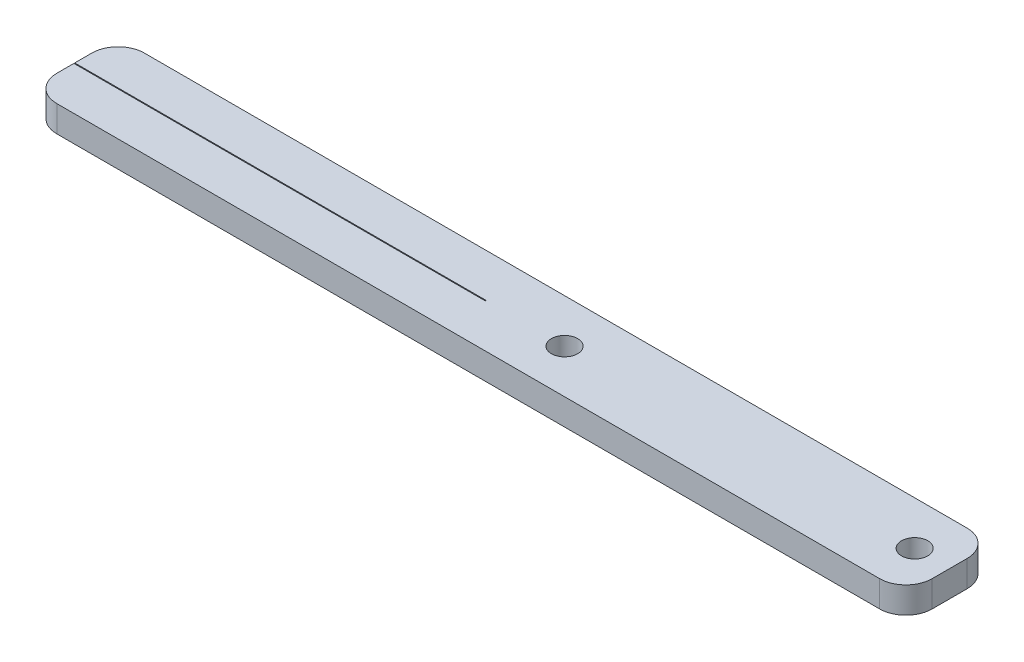
ISO-10303-21;
HEADER;
FILE_DESCRIPTION(('STEP AP214'),'2;1');
FILE_NAME('part.step','',(''),(''),'','','');
FILE_SCHEMA(('AUTOMOTIVE_DESIGN { 1 0 10303 214 1 1 1 1 }'));
ENDSEC;
DATA;
#1=APPLICATION_CONTEXT('core data for automotive mechanical design processes');
#2=APPLICATION_PROTOCOL_DEFINITION('international standard','automotive_design',2000,#1);
#3=PRODUCT_CONTEXT('',#1,'mechanical');
#4=PRODUCT('Part','Part','',(#3));
#5=PRODUCT_RELATED_PRODUCT_CATEGORY('part','',(#4));
#6=PRODUCT_DEFINITION_FORMATION('','',#4);
#7=PRODUCT_DEFINITION_CONTEXT('part definition',#1,'design');
#8=PRODUCT_DEFINITION('design','',#6,#7);
#9=PRODUCT_DEFINITION_SHAPE('','',#8);
#10=(LENGTH_UNIT() NAMED_UNIT(*) SI_UNIT(.MILLI.,.METRE.));
#11=(NAMED_UNIT(*) PLANE_ANGLE_UNIT() SI_UNIT($,.RADIAN.));
#12=(NAMED_UNIT(*) SI_UNIT($,.STERADIAN.) SOLID_ANGLE_UNIT());
#13=UNCERTAINTY_MEASURE_WITH_UNIT(LENGTH_MEASURE(1.E-05),#10,'distance_accuracy_value','');
#14=(GEOMETRIC_REPRESENTATION_CONTEXT(3) GLOBAL_UNCERTAINTY_ASSIGNED_CONTEXT((#13)) GLOBAL_UNIT_ASSIGNED_CONTEXT((#10,
#11,#12)) REPRESENTATION_CONTEXT('',''));
#15=CARTESIAN_POINT('',(0.,0.,0.));
#16=DIRECTION('',(0.,0.,1.));
#17=DIRECTION('',(1.,0.,0.));
#18=AXIS2_PLACEMENT_3D('',#15,#16,#17);
#19=CARTESIAN_POINT('',(-50.,3.,-4.99999999999999));
#20=DIRECTION('',(1.,0.,0.));
#21=DIRECTION('',(0.,0.,-1.));
#22=AXIS2_PLACEMENT_3D('',#19,#20,#21);
#23=PLANE('',#22);
#24=DIRECTION('',(0.,0.,1.));
#25=VECTOR('',#24,1.);
#26=CARTESIAN_POINT('',(-50.,0.,-4.99999999999999));
#27=LINE('',#26,#25);
#28=CARTESIAN_POINT('',(-50.,0.,-1.99999999999998));
#29=VERTEX_POINT('',#28);
#30=CARTESIAN_POINT('',(-50.,0.,-0.0499999999999945));
#31=VERTEX_POINT('',#30);
#32=EDGE_CURVE('E184',#29,#31,#27,.T.);
#33=ORIENTED_EDGE('',*,*,#32,.T.);
#34=DIRECTION('',(0.,0.999999999999999,0.));
#35=VECTOR('',#34,1.);
#36=CARTESIAN_POINT('',(-50.,-7.,-0.0499999999999876));
#37=LINE('',#36,#35);
#38=CARTESIAN_POINT('',(-50.,3.,-0.0499999999999945));
#39=VERTEX_POINT('',#38);
#40=EDGE_CURVE('E233',#31,#39,#37,.T.);
#41=ORIENTED_EDGE('',*,*,#40,.T.);
#42=DIRECTION('',(0.,0.,1.));
#43=VECTOR('',#42,1.);
#44=CARTESIAN_POINT('',(-50.,3.,-4.99999999999999));
#45=LINE('',#44,#43);
#46=CARTESIAN_POINT('',(-50.,3.,-1.99999999999999));
#47=VERTEX_POINT('',#46);
#48=EDGE_CURVE('E165',#47,#39,#45,.T.);
#49=ORIENTED_EDGE('',*,*,#48,.F.);
#50=DIRECTION('',(0.,-0.999999999999999,0.));
#51=VECTOR('',#50,1.);
#52=CARTESIAN_POINT('',(-50.,3.,-1.99999999999999));
#53=LINE('',#52,#51);
#54=EDGE_CURVE('E190',#47,#29,#53,.T.);
#55=ORIENTED_EDGE('',*,*,#54,.T.);
#56=EDGE_LOOP('',(#33,#41,#49,#55));
#57=FACE_BOUND('',#56,.T.);
#58=ADVANCED_FACE('F51',(#57),#23,.F.);
#59=CARTESIAN_POINT('',(50.0000000000001,2.99999999999999,-4.99999999999998));
#60=DIRECTION('',(-1.,0.,0.));
#61=DIRECTION('',(0.,0.,1.));
#62=AXIS2_PLACEMENT_3D('',#59,#60,#61);
#63=PLANE('',#62);
#64=DIRECTION('',(0.,0.,-1.));
#65=VECTOR('',#64,1.);
#66=CARTESIAN_POINT('',(50.0000000000001,2.99999999999999,-4.99999999999998));
#67=LINE('',#66,#65);
#68=CARTESIAN_POINT('',(50.0000000000001,3.,2.00000000000001));
#69=VERTEX_POINT('',#68);
#70=CARTESIAN_POINT('',(50.0000000000001,3.,-2.));
#71=VERTEX_POINT('',#70);
#72=EDGE_CURVE('E171',#69,#71,#67,.T.);
#73=ORIENTED_EDGE('',*,*,#72,.F.);
#74=DIRECTION('',(0.,-0.999999999999999,0.));
#75=VECTOR('',#74,1.);
#76=CARTESIAN_POINT('',(50.0000000000001,3.,2.00000000000001));
#77=LINE('',#76,#75);
#78=CARTESIAN_POINT('',(50.0000000000001,0.,1.99999999999999));
#79=VERTEX_POINT('',#78);
#80=EDGE_CURVE('E221',#69,#79,#77,.T.);
#81=ORIENTED_EDGE('',*,*,#80,.T.);
#82=DIRECTION('',(0.,0.,-1.));
#83=VECTOR('',#82,1.);
#84=CARTESIAN_POINT('',(50.0000000000001,0.,-4.99999999999998));
#85=LINE('',#84,#83);
#86=CARTESIAN_POINT('',(50.0000000000002,0.,-2.));
#87=VERTEX_POINT('',#86);
#88=EDGE_CURVE('E176',#79,#87,#85,.T.);
#89=ORIENTED_EDGE('',*,*,#88,.T.);
#90=DIRECTION('',(0.,-0.999999999999999,0.));
#91=VECTOR('',#90,1.);
#92=CARTESIAN_POINT('',(50.0000000000001,3.,-2.));
#93=LINE('',#92,#91);
#94=EDGE_CURVE('E219',#87,#71,#93,.F.);
#95=ORIENTED_EDGE('',*,*,#94,.T.);
#96=EDGE_LOOP('',(#73,#81,#89,#95));
#97=FACE_BOUND('',#96,.T.);
#98=ADVANCED_FACE('F285',(#97),#63,.F.);
#99=CARTESIAN_POINT('',(-50.,3.,-4.99999999999999));
#100=DIRECTION('',(0.,0.,1.));
#101=DIRECTION('',(1.,0.,0.));
#102=AXIS2_PLACEMENT_3D('',#99,#100,#101);
#103=PLANE('',#102);
#104=DIRECTION('',(-1.,0.,0.));
#105=VECTOR('',#104,1.);
#106=CARTESIAN_POINT('',(-50.,0.,-4.99999999999999));
#107=LINE('',#106,#105);
#108=CARTESIAN_POINT('',(47.0000000000001,0.,-4.99999999999999));
#109=VERTEX_POINT('',#108);
#110=CARTESIAN_POINT('',(-47.,0.,-4.99999999999999));
#111=VERTEX_POINT('',#110);
#112=EDGE_CURVE('E179',#109,#111,#107,.T.);
#113=ORIENTED_EDGE('',*,*,#112,.T.);
#114=DIRECTION('',(0.,-0.999999999999999,0.));
#115=VECTOR('',#114,1.);
#116=CARTESIAN_POINT('',(-47.,3.,-4.99999999999999));
#117=LINE('',#116,#115);
#118=CARTESIAN_POINT('',(-47.,3.,-4.99999999999999));
#119=VERTEX_POINT('',#118);
#120=EDGE_CURVE('E205',#111,#119,#117,.F.);
#121=ORIENTED_EDGE('',*,*,#120,.T.);
#122=DIRECTION('',(-1.,0.,0.));
#123=VECTOR('',#122,1.);
#124=CARTESIAN_POINT('',(-50.,3.,-4.99999999999999));
#125=LINE('',#124,#123);
#126=CARTESIAN_POINT('',(47.0000000000001,3.,-4.99999999999999));
#127=VERTEX_POINT('',#126);
#128=EDGE_CURVE('E166',#127,#119,#125,.T.);
#129=ORIENTED_EDGE('',*,*,#128,.F.);
#130=DIRECTION('',(0.,-0.999999999999999,0.));
#131=VECTOR('',#130,1.);
#132=CARTESIAN_POINT('',(47.0000000000001,3.,-4.99999999999999));
#133=LINE('',#132,#131);
#134=EDGE_CURVE('E202',#127,#109,#133,.T.);
#135=ORIENTED_EDGE('',*,*,#134,.T.);
#136=EDGE_LOOP('',(#113,#121,#129,#135));
#137=FACE_BOUND('',#136,.T.);
#138=ADVANCED_FACE('F262',(#137),#103,.F.);
#139=CARTESIAN_POINT('',(-50.,3.,0.0500000000000084));
#140=VERTEX_POINT('',#139);
#141=CARTESIAN_POINT('',(-50.,3.,2.00000000000001));
#142=VERTEX_POINT('',#141);
#143=EDGE_CURVE('E156',#140,#142,#45,.T.);
#144=ORIENTED_EDGE('',*,*,#143,.F.);
#145=DIRECTION('',(0.,0.999999999999999,0.));
#146=VECTOR('',#145,1.);
#147=CARTESIAN_POINT('',(-50.,-7.,0.0500000000000222));
#148=LINE('',#147,#146);
#149=CARTESIAN_POINT('',(-50.,0.,0.0500000000000014));
#150=VERTEX_POINT('',#149);
#151=EDGE_CURVE('E140',#150,#140,#148,.T.);
#152=ORIENTED_EDGE('',*,*,#151,.F.);
#153=CARTESIAN_POINT('',(-50.,0.,2.00000000000001));
#154=VERTEX_POINT('',#153);
#155=EDGE_CURVE('E183',#150,#154,#27,.T.);
#156=ORIENTED_EDGE('',*,*,#155,.T.);
#157=DIRECTION('',(0.,-0.999999999999999,0.));
#158=VECTOR('',#157,1.);
#159=CARTESIAN_POINT('',(-50.,3.,2.00000000000001));
#160=LINE('',#159,#158);
#161=EDGE_CURVE('E163',#154,#142,#160,.F.);
#162=ORIENTED_EDGE('',*,*,#161,.T.);
#163=EDGE_LOOP('',(#144,#152,#156,#162));
#164=FACE_BOUND('',#163,.T.);
#165=ADVANCED_FACE('F161',(#164),#23,.F.);
#166=CARTESIAN_POINT('',(-50.,3.,5.00000000000002));
#167=DIRECTION('',(0.,0.,-1.));
#168=DIRECTION('',(-1.,0.,0.));
#169=AXIS2_PLACEMENT_3D('',#166,#167,#168);
#170=PLANE('',#169);
#171=DIRECTION('',(1.,0.,0.));
#172=VECTOR('',#171,1.);
#173=CARTESIAN_POINT('',(-50.,3.,5.00000000000002));
#174=LINE('',#173,#172);
#175=CARTESIAN_POINT('',(-47.,3.,5.00000000000001));
#176=VERTEX_POINT('',#175);
#177=CARTESIAN_POINT('',(47.0000000000001,3.,5.00000000000001));
#178=VERTEX_POINT('',#177);
#179=EDGE_CURVE('E169',#176,#178,#174,.T.);
#180=ORIENTED_EDGE('',*,*,#179,.F.);
#181=DIRECTION('',(0.,-0.999999999999999,0.));
#182=VECTOR('',#181,1.);
#183=CARTESIAN_POINT('',(-47.,3.,5.00000000000001));
#184=LINE('',#183,#182);
#185=CARTESIAN_POINT('',(-47.,0.,5.00000000000001));
#186=VERTEX_POINT('',#185);
#187=EDGE_CURVE('E216',#176,#186,#184,.T.);
#188=ORIENTED_EDGE('',*,*,#187,.T.);
#189=DIRECTION('',(1.,0.,0.));
#190=VECTOR('',#189,1.);
#191=CARTESIAN_POINT('',(-50.,0.,5.00000000000001));
#192=LINE('',#191,#190);
#193=CARTESIAN_POINT('',(47.0000000000001,0.,5.00000000000001));
#194=VERTEX_POINT('',#193);
#195=EDGE_CURVE('E187',#186,#194,#192,.T.);
#196=ORIENTED_EDGE('',*,*,#195,.T.);
#197=DIRECTION('',(0.,-0.999999999999999,0.));
#198=VECTOR('',#197,1.);
#199=CARTESIAN_POINT('',(47.0000000000001,3.,5.00000000000001));
#200=LINE('',#199,#198);
#201=EDGE_CURVE('E74',#194,#178,#200,.F.);
#202=ORIENTED_EDGE('',*,*,#201,.T.);
#203=EDGE_LOOP('',(#180,#188,#196,#202));
#204=FACE_BOUND('',#203,.T.);
#205=ADVANCED_FACE('F294',(#204),#170,.F.);
#206=CARTESIAN_POINT('',(0.,3.,0.));
#207=DIRECTION('',(0.,0.999999999999999,0.));
#208=DIRECTION('',(0.,0.,1.));
#209=AXIS2_PLACEMENT_3D('',#206,#207,#208);
#210=PLANE('',#209);
#211=DIRECTION('',(-1.,0.,0.));
#212=VECTOR('',#211,1.);
#213=CARTESIAN_POINT('',(-2.99999999999995,2.99999999999999,-0.0499999999999945));
#214=LINE('',#213,#212);
#215=CARTESIAN_POINT('',(-2.99999999999995,2.99999999999999,-0.0499999999999945));
#216=VERTEX_POINT('',#215);
#217=EDGE_CURVE('E150',#216,#39,#214,.T.);
#218=ORIENTED_EDGE('',*,*,#217,.F.);
#219=DIRECTION('',(0.,0.,-1.));
#220=VECTOR('',#219,1.);
#221=CARTESIAN_POINT('',(-2.99999999999995,2.99999999999999,-0.0499999999999945));
#222=LINE('',#221,#220);
#223=CARTESIAN_POINT('',(-2.99999999999994,2.99999999999999,0.0500000000000084));
#224=VERTEX_POINT('',#223);
#225=EDGE_CURVE('E159',#224,#216,#222,.T.);
#226=ORIENTED_EDGE('',*,*,#225,.F.);
#227=DIRECTION('',(1.,0.,0.));
#228=VECTOR('',#227,1.);
#229=CARTESIAN_POINT('',(-2.99999999999994,2.99999999999999,0.0500000000000084));
#230=LINE('',#229,#228);
#231=EDGE_CURVE('E143',#140,#224,#230,.T.);
#232=ORIENTED_EDGE('',*,*,#231,.F.);
#233=ORIENTED_EDGE('',*,*,#143,.T.);
#234=CARTESIAN_POINT('',(-47.,2.99999999999999,2.00000000000001));
#235=DIRECTION('',(0.,0.999999999999999,0.));
#236=DIRECTION('',(0.,0.,1.));
#237=AXIS2_PLACEMENT_3D('',#234,#235,#236);
#238=CIRCLE('',#237,3.);
#239=EDGE_CURVE('E211',#142,#176,#238,.T.);
#240=ORIENTED_EDGE('',*,*,#239,.T.);
#241=ORIENTED_EDGE('',*,*,#179,.T.);
#242=CARTESIAN_POINT('',(47.0000000000001,3.,2.));
#243=DIRECTION('',(0.,0.999999999999999,0.));
#244=DIRECTION('',(0.,0.,1.));
#245=AXIS2_PLACEMENT_3D('',#242,#243,#244);
#246=CIRCLE('',#245,3.);
#247=EDGE_CURVE('E209',#178,#69,#246,.T.);
#248=ORIENTED_EDGE('',*,*,#247,.T.);
#249=ORIENTED_EDGE('',*,*,#72,.T.);
#250=CARTESIAN_POINT('',(47.0000000000001,3.00000000000001,-2.00000000000001));
#251=DIRECTION('',(0.,0.999999999999999,0.));
#252=DIRECTION('',(0.,0.,1.));
#253=AXIS2_PLACEMENT_3D('',#250,#251,#252);
#254=CIRCLE('',#253,3.);
#255=EDGE_CURVE('E207',#71,#127,#254,.T.);
#256=ORIENTED_EDGE('',*,*,#255,.T.);
#257=ORIENTED_EDGE('',*,*,#128,.T.);
#258=CARTESIAN_POINT('',(-47.,2.99999999999999,-1.99999999999999));
#259=DIRECTION('',(0.,0.999999999999999,0.));
#260=DIRECTION('',(0.,0.,1.));
#261=AXIS2_PLACEMENT_3D('',#258,#259,#260);
#262=CIRCLE('',#261,3.);
#263=EDGE_CURVE('E213',#119,#47,#262,.T.);
#264=ORIENTED_EDGE('',*,*,#263,.T.);
#265=ORIENTED_EDGE('',*,*,#48,.T.);
#266=EDGE_LOOP('',(#218,#226,#232,#233,#240,#241,#248,#249,#256,#257,#264,#265));
#267=FACE_BOUND('',#266,.T.);
#268=CARTESIAN_POINT('',(46.0000000000001,3.00000000000001,0.));
#269=DIRECTION('',(0.,0.999999999999999,0.));
#270=DIRECTION('',(0.,0.,1.));
#271=AXIS2_PLACEMENT_3D('',#268,#269,#270);
#272=CIRCLE('',#271,1.5);
#273=CARTESIAN_POINT('',(46.0000000000001,3.00000000000001,1.50000000000002));
#274=VERTEX_POINT('',#273);
#275=EDGE_CURVE('E236',#274,#274,#272,.T.);
#276=ORIENTED_EDGE('',*,*,#275,.F.);
#277=EDGE_LOOP('',(#276));
#278=FACE_BOUND('',#277,.T.);
#279=CARTESIAN_POINT('',(6.00000000000007,3.,0.));
#280=DIRECTION('',(0.,0.999999999999999,0.));
#281=DIRECTION('',(0.,0.,1.));
#282=AXIS2_PLACEMENT_3D('',#279,#280,#281);
#283=CIRCLE('',#282,1.5);
#284=CARTESIAN_POINT('',(6.00000000000007,3.,1.50000000000001));
#285=VERTEX_POINT('',#284);
#286=EDGE_CURVE('E246',#285,#285,#283,.T.);
#287=ORIENTED_EDGE('',*,*,#286,.F.);
#288=EDGE_LOOP('',(#287));
#289=FACE_BOUND('',#288,.T.);
#290=ADVANCED_FACE('F154',(#267,#278,#289),#210,.T.);
#291=CARTESIAN_POINT('',(0.,0.,0.));
#292=DIRECTION('',(0.,0.999999999999999,0.));
#293=DIRECTION('',(0.,0.,1.));
#294=AXIS2_PLACEMENT_3D('',#291,#292,#293);
#295=PLANE('',#294);
#296=CARTESIAN_POINT('',(46.0000000000001,0.,0.));
#297=DIRECTION('',(0.,0.999999999999999,0.));
#298=DIRECTION('',(0.,0.,1.));
#299=AXIS2_PLACEMENT_3D('',#296,#297,#298);
#300=CIRCLE('',#299,1.5);
#301=CARTESIAN_POINT('',(46.0000000000001,0.,1.50000000000002));
#302=VERTEX_POINT('',#301);
#303=EDGE_CURVE('E243',#302,#302,#300,.T.);
#304=ORIENTED_EDGE('',*,*,#303,.T.);
#305=EDGE_LOOP('',(#304));
#306=FACE_BOUND('',#305,.T.);
#307=CARTESIAN_POINT('',(6.00000000000007,0.,0.));
#308=DIRECTION('',(0.,0.999999999999999,0.));
#309=DIRECTION('',(0.,0.,1.));
#310=AXIS2_PLACEMENT_3D('',#307,#308,#309);
#311=CIRCLE('',#310,1.5);
#312=CARTESIAN_POINT('',(6.00000000000007,0.,1.50000000000001));
#313=VERTEX_POINT('',#312);
#314=EDGE_CURVE('E180',#313,#313,#311,.T.);
#315=ORIENTED_EDGE('',*,*,#314,.T.);
#316=EDGE_LOOP('',(#315));
#317=FACE_BOUND('',#316,.T.);
#318=DIRECTION('',(0.,0.,-1.));
#319=VECTOR('',#318,1.);
#320=CARTESIAN_POINT('',(-2.99999999999995,0.,0.));
#321=LINE('',#320,#319);
#322=CARTESIAN_POINT('',(-2.99999999999995,0.,0.0499999999999876));
#323=VERTEX_POINT('',#322);
#324=CARTESIAN_POINT('',(-2.99999999999994,0.,-0.0499999999999945));
#325=VERTEX_POINT('',#324);
#326=EDGE_CURVE('E59',#323,#325,#321,.T.);
#327=ORIENTED_EDGE('',*,*,#326,.T.);
#328=DIRECTION('',(-1.,0.,0.));
#329=VECTOR('',#328,1.);
#330=CARTESIAN_POINT('',(0.,0.,-0.0500000000000153));
#331=LINE('',#330,#329);
#332=EDGE_CURVE('E13',#325,#31,#331,.T.);
#333=ORIENTED_EDGE('',*,*,#332,.T.);
#334=ORIENTED_EDGE('',*,*,#32,.F.);
#335=CARTESIAN_POINT('',(-47.,0.,-1.99999999999999));
#336=DIRECTION('',(0.,0.999999999999999,0.));
#337=DIRECTION('',(0.,0.,1.));
#338=AXIS2_PLACEMENT_3D('',#335,#336,#337);
#339=CIRCLE('',#338,3.);
#340=EDGE_CURVE('E200',#29,#111,#339,.F.);
#341=ORIENTED_EDGE('',*,*,#340,.T.);
#342=ORIENTED_EDGE('',*,*,#112,.F.);
#343=CARTESIAN_POINT('',(47.0000000000001,0.,-2.));
#344=DIRECTION('',(0.,0.999999999999999,0.));
#345=DIRECTION('',(0.,0.,1.));
#346=AXIS2_PLACEMENT_3D('',#343,#344,#345);
#347=CIRCLE('',#346,3.);
#348=EDGE_CURVE('E193',#109,#87,#347,.F.);
#349=ORIENTED_EDGE('',*,*,#348,.T.);
#350=ORIENTED_EDGE('',*,*,#88,.F.);
#351=CARTESIAN_POINT('',(47.0000000000001,0.,1.99999999999999));
#352=DIRECTION('',(0.,0.999999999999999,0.));
#353=DIRECTION('',(0.,0.,1.));
#354=AXIS2_PLACEMENT_3D('',#351,#352,#353);
#355=CIRCLE('',#354,3.);
#356=EDGE_CURVE('E195',#79,#194,#355,.F.);
#357=ORIENTED_EDGE('',*,*,#356,.T.);
#358=ORIENTED_EDGE('',*,*,#195,.F.);
#359=CARTESIAN_POINT('',(-47.,0.,2.));
#360=DIRECTION('',(0.,0.999999999999999,0.));
#361=DIRECTION('',(0.,0.,1.));
#362=AXIS2_PLACEMENT_3D('',#359,#360,#361);
#363=CIRCLE('',#362,3.);
#364=EDGE_CURVE('E197',#186,#154,#363,.F.);
#365=ORIENTED_EDGE('',*,*,#364,.T.);
#366=ORIENTED_EDGE('',*,*,#155,.F.);
#367=DIRECTION('',(1.,0.,0.));
#368=VECTOR('',#367,1.);
#369=CARTESIAN_POINT('',(0.,0.,0.0499999999999945));
#370=LINE('',#369,#368);
#371=EDGE_CURVE('E146',#150,#323,#370,.T.);
#372=ORIENTED_EDGE('',*,*,#371,.T.);
#373=EDGE_LOOP('',(#327,#333,#334,#341,#342,#349,#350,#357,#358,#365,#366,#372));
#374=FACE_BOUND('',#373,.T.);
#375=ADVANCED_FACE('F226',(#306,#317,#374),#295,.F.);
#376=CARTESIAN_POINT('',(-47.,2.99999999999999,-1.99999999999999));
#377=DIRECTION('',(0.,-0.999999999999999,0.));
#378=DIRECTION('',(0.,0.,-1.));
#379=AXIS2_PLACEMENT_3D('',#376,#377,#378);
#380=CYLINDRICAL_SURFACE('',#379,3.);
#381=ORIENTED_EDGE('',*,*,#263,.F.);
#382=ORIENTED_EDGE('',*,*,#120,.F.);
#383=ORIENTED_EDGE('',*,*,#340,.F.);
#384=ORIENTED_EDGE('',*,*,#54,.F.);
#385=EDGE_LOOP('',(#381,#382,#383,#384));
#386=FACE_BOUND('',#385,.T.);
#387=ADVANCED_FACE('F268',(#386),#380,.T.);
#388=CARTESIAN_POINT('',(-47.,2.99999999999999,2.00000000000001));
#389=DIRECTION('',(0.,-0.999999999999999,0.));
#390=DIRECTION('',(0.,0.,-1.));
#391=AXIS2_PLACEMENT_3D('',#388,#389,#390);
#392=CYLINDRICAL_SURFACE('',#391,3.);
#393=ORIENTED_EDGE('',*,*,#239,.F.);
#394=ORIENTED_EDGE('',*,*,#161,.F.);
#395=ORIENTED_EDGE('',*,*,#364,.F.);
#396=ORIENTED_EDGE('',*,*,#187,.F.);
#397=EDGE_LOOP('',(#393,#394,#395,#396));
#398=FACE_BOUND('',#397,.T.);
#399=ADVANCED_FACE('F304',(#398),#392,.T.);
#400=CARTESIAN_POINT('',(47.0000000000001,3.,2.));
#401=DIRECTION('',(0.,-0.999999999999999,0.));
#402=DIRECTION('',(0.,0.,-1.));
#403=AXIS2_PLACEMENT_3D('',#400,#401,#402);
#404=CYLINDRICAL_SURFACE('',#403,3.);
#405=ORIENTED_EDGE('',*,*,#247,.F.);
#406=ORIENTED_EDGE('',*,*,#201,.F.);
#407=ORIENTED_EDGE('',*,*,#356,.F.);
#408=ORIENTED_EDGE('',*,*,#80,.F.);
#409=EDGE_LOOP('',(#405,#406,#407,#408));
#410=FACE_BOUND('',#409,.T.);
#411=ADVANCED_FACE('F306',(#410),#404,.T.);
#412=CARTESIAN_POINT('',(47.0000000000001,3.00000000000001,-2.00000000000001));
#413=DIRECTION('',(0.,-0.999999999999999,0.));
#414=DIRECTION('',(0.,0.,-1.));
#415=AXIS2_PLACEMENT_3D('',#412,#413,#414);
#416=CYLINDRICAL_SURFACE('',#415,3.);
#417=ORIENTED_EDGE('',*,*,#255,.F.);
#418=ORIENTED_EDGE('',*,*,#94,.F.);
#419=ORIENTED_EDGE('',*,*,#348,.F.);
#420=ORIENTED_EDGE('',*,*,#134,.F.);
#421=EDGE_LOOP('',(#417,#418,#419,#420));
#422=FACE_BOUND('',#421,.T.);
#423=ADVANCED_FACE('F53',(#422),#416,.T.);
#424=CARTESIAN_POINT('',(6.00000000000007,3.,0.));
#425=DIRECTION('',(0.,0.999999999999999,0.));
#426=DIRECTION('',(0.,0.,1.));
#427=AXIS2_PLACEMENT_3D('',#424,#425,#426);
#428=CYLINDRICAL_SURFACE('',#427,1.5);
#429=ORIENTED_EDGE('',*,*,#314,.F.);
#430=EDGE_LOOP('',(#429));
#431=FACE_BOUND('',#430,.T.);
#432=ORIENTED_EDGE('',*,*,#286,.T.);
#433=EDGE_LOOP('',(#432));
#434=FACE_BOUND('',#433,.T.);
#435=ADVANCED_FACE('F281',(#431,#434),#428,.F.);
#436=CARTESIAN_POINT('',(46.0000000000001,3.00000000000001,0.));
#437=DIRECTION('',(0.,0.999999999999999,0.));
#438=DIRECTION('',(0.,0.,1.));
#439=AXIS2_PLACEMENT_3D('',#436,#437,#438);
#440=CYLINDRICAL_SURFACE('',#439,1.5);
#441=ORIENTED_EDGE('',*,*,#303,.F.);
#442=EDGE_LOOP('',(#441));
#443=FACE_BOUND('',#442,.T.);
#444=ORIENTED_EDGE('',*,*,#275,.T.);
#445=EDGE_LOOP('',(#444));
#446=FACE_BOUND('',#445,.T.);
#447=ADVANCED_FACE('F274',(#443,#446),#440,.F.);
#448=CARTESIAN_POINT('',(-2.99999999999995,-7.00000000000001,-0.0499999999999876));
#449=DIRECTION('',(0.,0.,-1.));
#450=DIRECTION('',(-1.,0.,0.));
#451=AXIS2_PLACEMENT_3D('',#448,#449,#450);
#452=PLANE('',#451);
#453=DIRECTION('',(0.,0.999999999999999,0.));
#454=VECTOR('',#453,1.);
#455=CARTESIAN_POINT('',(-2.99999999999995,-7.00000000000001,-0.0499999999999876));
#456=LINE('',#455,#454);
#457=EDGE_CURVE('E231',#325,#216,#456,.T.);
#458=ORIENTED_EDGE('',*,*,#457,.T.);
#459=ORIENTED_EDGE('',*,*,#217,.T.);
#460=ORIENTED_EDGE('',*,*,#40,.F.);
#461=ORIENTED_EDGE('',*,*,#332,.F.);
#462=EDGE_LOOP('',(#458,#459,#460,#461));
#463=FACE_BOUND('',#462,.T.);
#464=ADVANCED_FACE('F272',(#463),#452,.F.);
#465=CARTESIAN_POINT('',(-2.99999999999995,-7.00000000000001,-0.0499999999999876));
#466=DIRECTION('',(1.,0.,0.));
#467=DIRECTION('',(0.,0.,-1.));
#468=AXIS2_PLACEMENT_3D('',#465,#466,#467);
#469=PLANE('',#468);
#470=DIRECTION('',(0.,0.999999999999999,0.));
#471=VECTOR('',#470,1.);
#472=CARTESIAN_POINT('',(-2.99999999999995,-7.00000000000001,0.0500000000000292));
#473=LINE('',#472,#471);
#474=EDGE_CURVE('E66',#323,#224,#473,.T.);
#475=ORIENTED_EDGE('',*,*,#474,.T.);
#476=ORIENTED_EDGE('',*,*,#225,.T.);
#477=ORIENTED_EDGE('',*,*,#457,.F.);
#478=ORIENTED_EDGE('',*,*,#326,.F.);
#479=EDGE_LOOP('',(#475,#476,#477,#478));
#480=FACE_BOUND('',#479,.T.);
#481=ADVANCED_FACE('F230',(#480),#469,.F.);
#482=CARTESIAN_POINT('',(-2.99999999999995,-7.00000000000001,0.0500000000000292));
#483=DIRECTION('',(0.,0.,1.));
#484=DIRECTION('',(1.,0.,0.));
#485=AXIS2_PLACEMENT_3D('',#482,#483,#484);
#486=PLANE('',#485);
#487=ORIENTED_EDGE('',*,*,#151,.T.);
#488=ORIENTED_EDGE('',*,*,#231,.T.);
#489=ORIENTED_EDGE('',*,*,#474,.F.);
#490=ORIENTED_EDGE('',*,*,#371,.F.);
#491=EDGE_LOOP('',(#487,#488,#489,#490));
#492=FACE_BOUND('',#491,.T.);
#493=ADVANCED_FACE('F142',(#492),#486,.F.);
#494=CLOSED_SHELL('',(#58,#98,#138,#165,#205,#290,#375,#387,#399,#411,#423,#435,#447,#464,#481,#493));
#495=MANIFOLD_SOLID_BREP('B2',#494);
#496=ADVANCED_BREP_SHAPE_REPRESENTATION('',(#18,#495),#14);
#497=SHAPE_DEFINITION_REPRESENTATION(#9,#496);
ENDSEC;
END-ISO-10303-21;
